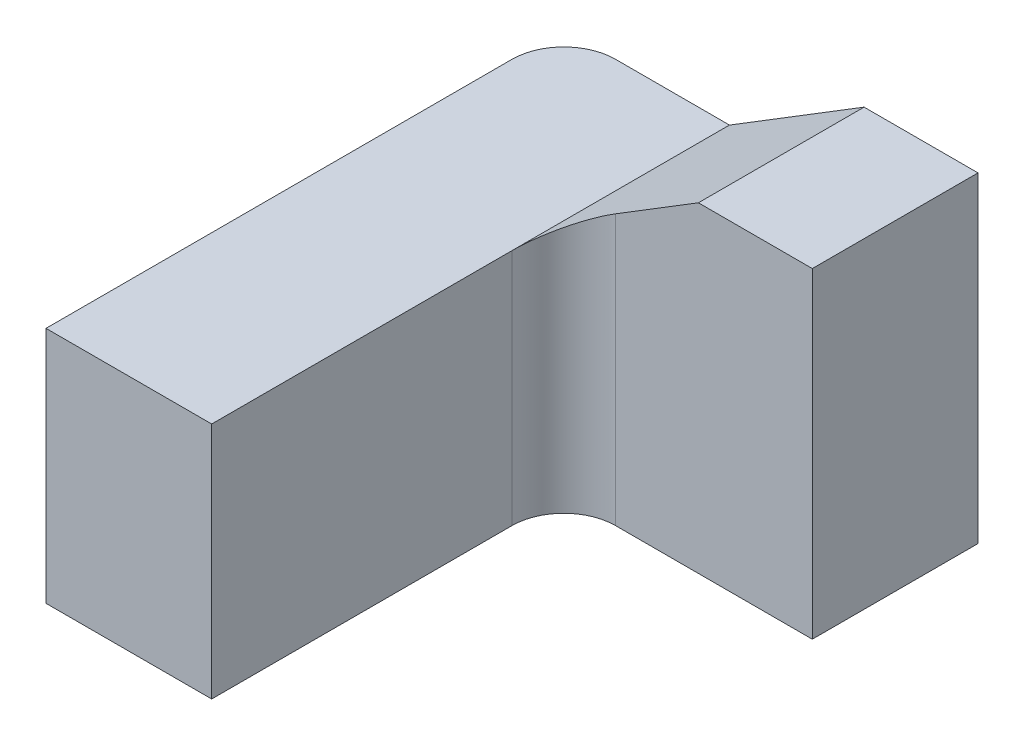
ISO-10303-21;
HEADER;
FILE_DESCRIPTION(('STEP AP214'),'2;1');
FILE_NAME('part.step','',(''),(''),'','','');
FILE_SCHEMA(('AUTOMOTIVE_DESIGN { 1 0 10303 214 1 1 1 1 }'));
ENDSEC;
DATA;
#1=APPLICATION_CONTEXT('core data for automotive mechanical design processes');
#2=APPLICATION_PROTOCOL_DEFINITION('international standard','automotive_design',2000,#1);
#3=PRODUCT_CONTEXT('',#1,'mechanical');
#4=PRODUCT('Part','Part','',(#3));
#5=PRODUCT_RELATED_PRODUCT_CATEGORY('part','',(#4));
#6=PRODUCT_DEFINITION_FORMATION('','',#4);
#7=PRODUCT_DEFINITION_CONTEXT('part definition',#1,'design');
#8=PRODUCT_DEFINITION('design','',#6,#7);
#9=PRODUCT_DEFINITION_SHAPE('','',#8);
#10=(LENGTH_UNIT() NAMED_UNIT(*) SI_UNIT(.MILLI.,.METRE.));
#11=(NAMED_UNIT(*) PLANE_ANGLE_UNIT() SI_UNIT($,.RADIAN.));
#12=(NAMED_UNIT(*) SI_UNIT($,.STERADIAN.) SOLID_ANGLE_UNIT());
#13=UNCERTAINTY_MEASURE_WITH_UNIT(LENGTH_MEASURE(1.E-05),#10,'distance_accuracy_value','');
#14=(GEOMETRIC_REPRESENTATION_CONTEXT(3) GLOBAL_UNCERTAINTY_ASSIGNED_CONTEXT((#13)) GLOBAL_UNIT_ASSIGNED_CONTEXT((#10,
#11,#12)) REPRESENTATION_CONTEXT('',''));
#15=CARTESIAN_POINT('',(0.,0.,0.));
#16=DIRECTION('',(0.,0.,1.));
#17=DIRECTION('',(1.,0.,0.));
#18=AXIS2_PLACEMENT_3D('',#15,#16,#17);
#19=CARTESIAN_POINT('',(0.,0.,0.16));
#20=DIRECTION('',(0.,0.,-1.));
#21=DIRECTION('',(-1.,0.,0.));
#22=AXIS2_PLACEMENT_3D('',#19,#20,#21);
#23=PLANE('',#22);
#24=DIRECTION('',(0.851658316704544,0.524097425664335,0.));
#25=VECTOR('',#24,1.);
#26=CARTESIAN_POINT('',(0.16,0.23,0.16));
#27=LINE('',#26,#25);
#28=CARTESIAN_POINT('',(0.21,0.260769230769231,0.16));
#29=VERTEX_POINT('',#28);
#30=CARTESIAN_POINT('',(0.29,0.31,0.16));
#31=VERTEX_POINT('',#30);
#32=EDGE_CURVE('E146',#29,#31,#27,.T.);
#33=ORIENTED_EDGE('',*,*,#32,.F.);
#34=DIRECTION('',(0.,1.,0.));
#35=VECTOR('',#34,1.);
#36=CARTESIAN_POINT('',(0.21,0.,0.16));
#37=LINE('',#36,#35);
#38=CARTESIAN_POINT('',(0.21,0.,0.16));
#39=VERTEX_POINT('',#38);
#40=EDGE_CURVE('E187',#29,#39,#37,.F.);
#41=ORIENTED_EDGE('',*,*,#40,.T.);
#42=DIRECTION('',(1.,0.,0.));
#43=VECTOR('',#42,1.);
#44=CARTESIAN_POINT('',(0.,0.,0.16));
#45=LINE('',#44,#43);
#46=CARTESIAN_POINT('',(0.4,0.,0.16));
#47=VERTEX_POINT('',#46);
#48=EDGE_CURVE('E121',#39,#47,#45,.T.);
#49=ORIENTED_EDGE('',*,*,#48,.T.);
#50=DIRECTION('',(0.,1.,0.));
#51=VECTOR('',#50,1.);
#52=CARTESIAN_POINT('',(0.4,0.,0.16));
#53=LINE('',#52,#51);
#54=CARTESIAN_POINT('',(0.4,0.31,0.16));
#55=VERTEX_POINT('',#54);
#56=EDGE_CURVE('E152',#47,#55,#53,.T.);
#57=ORIENTED_EDGE('',*,*,#56,.T.);
#58=DIRECTION('',(-1.,0.,0.));
#59=VECTOR('',#58,1.);
#60=CARTESIAN_POINT('',(0.4,0.31,0.16));
#61=LINE('',#60,#59);
#62=EDGE_CURVE('E148',#55,#31,#61,.T.);
#63=ORIENTED_EDGE('',*,*,#62,.T.);
#64=EDGE_LOOP('',(#33,#41,#49,#57,#63));
#65=FACE_BOUND('',#64,.T.);
#66=ADVANCED_FACE('F42',(#65),#23,.F.);
#67=CARTESIAN_POINT('',(0.,0.,0.16));
#68=DIRECTION('',(-1.,0.,0.));
#69=DIRECTION('',(0.,0.,1.));
#70=AXIS2_PLACEMENT_3D('',#67,#68,#69);
#71=PLANE('',#70);
#72=DIRECTION('',(0.,0.,-1.));
#73=VECTOR('',#72,1.);
#74=CARTESIAN_POINT('',(0.,0.23,0.16));
#75=LINE('',#74,#73);
#76=CARTESIAN_POINT('',(0.,0.23,0.5));
#77=VERTEX_POINT('',#76);
#78=CARTESIAN_POINT('',(0.,0.23,0.05));
#79=VERTEX_POINT('',#78);
#80=EDGE_CURVE('E110',#77,#79,#75,.T.);
#81=ORIENTED_EDGE('',*,*,#80,.T.);
#82=DIRECTION('',(0.,1.,0.));
#83=VECTOR('',#82,1.);
#84=CARTESIAN_POINT('',(0.,0.,0.05));
#85=LINE('',#84,#83);
#86=CARTESIAN_POINT('',(0.,0.,0.05));
#87=VERTEX_POINT('',#86);
#88=EDGE_CURVE('E180',#79,#87,#85,.F.);
#89=ORIENTED_EDGE('',*,*,#88,.T.);
#90=DIRECTION('',(0.,0.,-1.));
#91=VECTOR('',#90,1.);
#92=CARTESIAN_POINT('',(0.,0.,0.16));
#93=LINE('',#92,#91);
#94=CARTESIAN_POINT('',(0.,0.,0.5));
#95=VERTEX_POINT('',#94);
#96=EDGE_CURVE('E127',#95,#87,#93,.T.);
#97=ORIENTED_EDGE('',*,*,#96,.F.);
#98=DIRECTION('',(0.,-1.,0.));
#99=VECTOR('',#98,1.);
#100=CARTESIAN_POINT('',(0.,0.,0.5));
#101=LINE('',#100,#99);
#102=EDGE_CURVE('E124',#77,#95,#101,.T.);
#103=ORIENTED_EDGE('',*,*,#102,.F.);
#104=EDGE_LOOP('',(#81,#89,#97,#103));
#105=FACE_BOUND('',#104,.T.);
#106=ADVANCED_FACE('F125',(#105),#71,.T.);
#107=CARTESIAN_POINT('',(0.,0.,0.16));
#108=DIRECTION('',(0.,1.,0.));
#109=DIRECTION('',(0.,0.,1.));
#110=AXIS2_PLACEMENT_3D('',#107,#108,#109);
#111=PLANE('',#110);
#112=ORIENTED_EDGE('',*,*,#96,.T.);
#113=CARTESIAN_POINT('',(0.05,0.,0.05));
#114=DIRECTION('',(0.,1.,0.));
#115=DIRECTION('',(0.,0.,1.));
#116=AXIS2_PLACEMENT_3D('',#113,#114,#115);
#117=CIRCLE('',#116,0.05);
#118=CARTESIAN_POINT('',(0.05,0.,0.));
#119=VERTEX_POINT('',#118);
#120=EDGE_CURVE('E182',#87,#119,#117,.F.);
#121=ORIENTED_EDGE('',*,*,#120,.T.);
#122=DIRECTION('',(1.,0.,0.));
#123=VECTOR('',#122,1.);
#124=CARTESIAN_POINT('',(0.,0.,0.));
#125=LINE('',#124,#123);
#126=CARTESIAN_POINT('',(0.4,0.,0.));
#127=VERTEX_POINT('',#126);
#128=EDGE_CURVE('E149',#119,#127,#125,.T.);
#129=ORIENTED_EDGE('',*,*,#128,.T.);
#130=DIRECTION('',(0.,0.,-1.));
#131=VECTOR('',#130,1.);
#132=CARTESIAN_POINT('',(0.4,0.,0.16));
#133=LINE('',#132,#131);
#134=EDGE_CURVE('E167',#47,#127,#133,.T.);
#135=ORIENTED_EDGE('',*,*,#134,.F.);
#136=ORIENTED_EDGE('',*,*,#48,.F.);
#137=CARTESIAN_POINT('',(0.21,0.,0.21));
#138=DIRECTION('',(0.,1.,0.));
#139=DIRECTION('',(0.,0.,1.));
#140=AXIS2_PLACEMENT_3D('',#137,#138,#139);
#141=CIRCLE('',#140,0.05);
#142=CARTESIAN_POINT('',(0.16,0.,0.21));
#143=VERTEX_POINT('',#142);
#144=EDGE_CURVE('E11',#39,#143,#141,.T.);
#145=ORIENTED_EDGE('',*,*,#144,.T.);
#146=DIRECTION('',(0.,0.,-1.));
#147=VECTOR('',#146,1.);
#148=CARTESIAN_POINT('',(0.16,0.,0.5));
#149=LINE('',#148,#147);
#150=CARTESIAN_POINT('',(0.16,0.,0.5));
#151=VERTEX_POINT('',#150);
#152=EDGE_CURVE('E142',#151,#143,#149,.T.);
#153=ORIENTED_EDGE('',*,*,#152,.F.);
#154=DIRECTION('',(1.,0.,0.));
#155=VECTOR('',#154,1.);
#156=CARTESIAN_POINT('',(0.16,0.,0.5));
#157=LINE('',#156,#155);
#158=EDGE_CURVE('E130',#95,#151,#157,.T.);
#159=ORIENTED_EDGE('',*,*,#158,.F.);
#160=EDGE_LOOP('',(#112,#121,#129,#135,#136,#145,#153,#159));
#161=FACE_BOUND('',#160,.T.);
#162=ADVANCED_FACE('F195',(#161),#111,.F.);
#163=CARTESIAN_POINT('',(0.4,0.,0.16));
#164=DIRECTION('',(-1.,0.,0.));
#165=DIRECTION('',(0.,0.,1.));
#166=AXIS2_PLACEMENT_3D('',#163,#164,#165);
#167=PLANE('',#166);
#168=DIRECTION('',(0.,1.,0.));
#169=VECTOR('',#168,1.);
#170=CARTESIAN_POINT('',(0.4,0.,0.));
#171=LINE('',#170,#169);
#172=CARTESIAN_POINT('',(0.4,0.31,0.));
#173=VERTEX_POINT('',#172);
#174=EDGE_CURVE('E162',#127,#173,#171,.T.);
#175=ORIENTED_EDGE('',*,*,#174,.T.);
#176=DIRECTION('',(0.,0.,-1.));
#177=VECTOR('',#176,1.);
#178=CARTESIAN_POINT('',(0.4,0.31,0.16));
#179=LINE('',#178,#177);
#180=EDGE_CURVE('E170',#55,#173,#179,.T.);
#181=ORIENTED_EDGE('',*,*,#180,.F.);
#182=ORIENTED_EDGE('',*,*,#56,.F.);
#183=ORIENTED_EDGE('',*,*,#134,.T.);
#184=EDGE_LOOP('',(#175,#181,#182,#183));
#185=FACE_BOUND('',#184,.T.);
#186=ADVANCED_FACE('F214',(#185),#167,.F.);
#187=CARTESIAN_POINT('',(0.4,0.31,0.16));
#188=DIRECTION('',(0.,-1.,0.));
#189=DIRECTION('',(0.,0.,-1.));
#190=AXIS2_PLACEMENT_3D('',#187,#188,#189);
#191=PLANE('',#190);
#192=DIRECTION('',(-1.,0.,0.));
#193=VECTOR('',#192,1.);
#194=CARTESIAN_POINT('',(0.4,0.31,0.));
#195=LINE('',#194,#193);
#196=CARTESIAN_POINT('',(0.29,0.31,0.));
#197=VERTEX_POINT('',#196);
#198=EDGE_CURVE('E159',#173,#197,#195,.T.);
#199=ORIENTED_EDGE('',*,*,#198,.T.);
#200=DIRECTION('',(0.,0.,-1.));
#201=VECTOR('',#200,1.);
#202=CARTESIAN_POINT('',(0.29,0.31,0.16));
#203=LINE('',#202,#201);
#204=EDGE_CURVE('E173',#31,#197,#203,.T.);
#205=ORIENTED_EDGE('',*,*,#204,.F.);
#206=ORIENTED_EDGE('',*,*,#62,.F.);
#207=ORIENTED_EDGE('',*,*,#180,.T.);
#208=EDGE_LOOP('',(#199,#205,#206,#207));
#209=FACE_BOUND('',#208,.T.);
#210=ADVANCED_FACE('F218',(#209),#191,.F.);
#211=CARTESIAN_POINT('',(0.16,0.23,0.16));
#212=DIRECTION('',(-0.524097425664335,0.851658316704544,0.));
#213=DIRECTION('',(-0.851658316704544,-0.524097425664335,0.));
#214=AXIS2_PLACEMENT_3D('',#211,#212,#213);
#215=PLANE('',#214);
#216=DIRECTION('',(0.851658316704544,0.524097425664335,0.));
#217=VECTOR('',#216,1.);
#218=CARTESIAN_POINT('',(0.16,0.23,0.));
#219=LINE('',#218,#217);
#220=CARTESIAN_POINT('',(0.16,0.23,0.));
#221=VERTEX_POINT('',#220);
#222=EDGE_CURVE('E156',#221,#197,#219,.T.);
#223=ORIENTED_EDGE('',*,*,#222,.F.);
#224=DIRECTION('',(0.,0.,-1.));
#225=VECTOR('',#224,1.);
#226=CARTESIAN_POINT('',(0.16,0.23,0.16));
#227=LINE('',#226,#225);
#228=CARTESIAN_POINT('',(0.16,0.23,0.21));
#229=VERTEX_POINT('',#228);
#230=EDGE_CURVE('E120',#229,#221,#227,.T.);
#231=ORIENTED_EDGE('',*,*,#230,.F.);
#232=CARTESIAN_POINT('',(0.21,0.260769230769231,0.21));
#233=DIRECTION('',(-0.524097425664335,0.851658316704544,0.));
#234=DIRECTION('',(-0.851658316704544,-0.524097425664335,0.));
#235=AXIS2_PLACEMENT_3D('',#232,#233,#234);
#236=ELLIPSE('',#235,0.0587089904710529,0.05);
#237=EDGE_CURVE('E51',#229,#29,#236,.F.);
#238=ORIENTED_EDGE('',*,*,#237,.T.);
#239=ORIENTED_EDGE('',*,*,#32,.T.);
#240=ORIENTED_EDGE('',*,*,#204,.T.);
#241=EDGE_LOOP('',(#223,#231,#238,#239,#240));
#242=FACE_BOUND('',#241,.T.);
#243=ADVANCED_FACE('F202',(#242),#215,.T.);
#244=CARTESIAN_POINT('',(0.,0.23,0.16));
#245=DIRECTION('',(0.,1.,0.));
#246=DIRECTION('',(0.,0.,1.));
#247=AXIS2_PLACEMENT_3D('',#244,#245,#246);
#248=PLANE('',#247);
#249=DIRECTION('',(1.,0.,0.));
#250=VECTOR('',#249,1.);
#251=CARTESIAN_POINT('',(0.,0.23,0.));
#252=LINE('',#251,#250);
#253=CARTESIAN_POINT('',(0.05,0.23,0.));
#254=VERTEX_POINT('',#253);
#255=EDGE_CURVE('E145',#254,#221,#252,.T.);
#256=ORIENTED_EDGE('',*,*,#255,.F.);
#257=CARTESIAN_POINT('',(0.05,0.23,0.05));
#258=DIRECTION('',(0.,1.,0.));
#259=DIRECTION('',(0.,0.,1.));
#260=AXIS2_PLACEMENT_3D('',#257,#258,#259);
#261=CIRCLE('',#260,0.05);
#262=EDGE_CURVE('E117',#254,#79,#261,.T.);
#263=ORIENTED_EDGE('',*,*,#262,.T.);
#264=ORIENTED_EDGE('',*,*,#80,.F.);
#265=DIRECTION('',(-1.,0.,0.));
#266=VECTOR('',#265,1.);
#267=CARTESIAN_POINT('',(0.16,0.23,0.5));
#268=LINE('',#267,#266);
#269=CARTESIAN_POINT('',(0.16,0.23,0.5));
#270=VERTEX_POINT('',#269);
#271=EDGE_CURVE('E116',#270,#77,#268,.T.);
#272=ORIENTED_EDGE('',*,*,#271,.F.);
#273=DIRECTION('',(0.,0.,-1.));
#274=VECTOR('',#273,1.);
#275=CARTESIAN_POINT('',(0.16,0.23,0.5));
#276=LINE('',#275,#274);
#277=EDGE_CURVE('E140',#270,#229,#276,.T.);
#278=ORIENTED_EDGE('',*,*,#277,.T.);
#279=ORIENTED_EDGE('',*,*,#230,.T.);
#280=EDGE_LOOP('',(#256,#263,#264,#272,#278,#279));
#281=FACE_BOUND('',#280,.T.);
#282=ADVANCED_FACE('F113',(#281),#248,.T.);
#283=CARTESIAN_POINT('',(0.,0.,0.));
#284=DIRECTION('',(0.,0.,-1.));
#285=DIRECTION('',(-1.,0.,0.));
#286=AXIS2_PLACEMENT_3D('',#283,#284,#285);
#287=PLANE('',#286);
#288=ORIENTED_EDGE('',*,*,#128,.F.);
#289=DIRECTION('',(0.,1.,0.));
#290=VECTOR('',#289,1.);
#291=CARTESIAN_POINT('',(0.05,0.,0.));
#292=LINE('',#291,#290);
#293=EDGE_CURVE('E166',#119,#254,#292,.T.);
#294=ORIENTED_EDGE('',*,*,#293,.T.);
#295=ORIENTED_EDGE('',*,*,#255,.T.);
#296=ORIENTED_EDGE('',*,*,#222,.T.);
#297=ORIENTED_EDGE('',*,*,#198,.F.);
#298=ORIENTED_EDGE('',*,*,#174,.F.);
#299=EDGE_LOOP('',(#288,#294,#295,#296,#297,#298));
#300=FACE_BOUND('',#299,.T.);
#301=ADVANCED_FACE('F207',(#300),#287,.T.);
#302=CARTESIAN_POINT('',(0.16,0.,0.5));
#303=DIRECTION('',(-1.,0.,0.));
#304=DIRECTION('',(0.,-1.,0.));
#305=AXIS2_PLACEMENT_3D('',#302,#303,#304);
#306=PLANE('',#305);
#307=ORIENTED_EDGE('',*,*,#152,.T.);
#308=DIRECTION('',(0.,1.,0.));
#309=VECTOR('',#308,1.);
#310=CARTESIAN_POINT('',(0.16,0.23,0.21));
#311=LINE('',#310,#309);
#312=EDGE_CURVE('E184',#143,#229,#311,.T.);
#313=ORIENTED_EDGE('',*,*,#312,.T.);
#314=ORIENTED_EDGE('',*,*,#277,.F.);
#315=DIRECTION('',(0.,1.,0.));
#316=VECTOR('',#315,1.);
#317=CARTESIAN_POINT('',(0.16,0.,0.5));
#318=LINE('',#317,#316);
#319=EDGE_CURVE('E134',#151,#270,#318,.T.);
#320=ORIENTED_EDGE('',*,*,#319,.F.);
#321=EDGE_LOOP('',(#307,#313,#314,#320));
#322=FACE_BOUND('',#321,.T.);
#323=ADVANCED_FACE('F200',(#322),#306,.F.);
#324=CARTESIAN_POINT('',(0.,0.,0.5));
#325=DIRECTION('',(0.,0.,-1.));
#326=DIRECTION('',(-1.,0.,0.));
#327=AXIS2_PLACEMENT_3D('',#324,#325,#326);
#328=PLANE('',#327);
#329=ORIENTED_EDGE('',*,*,#271,.T.);
#330=ORIENTED_EDGE('',*,*,#102,.T.);
#331=ORIENTED_EDGE('',*,*,#158,.T.);
#332=ORIENTED_EDGE('',*,*,#319,.T.);
#333=EDGE_LOOP('',(#329,#330,#331,#332));
#334=FACE_BOUND('',#333,.T.);
#335=ADVANCED_FACE('F132',(#334),#328,.F.);
#336=CARTESIAN_POINT('',(0.05,0.,0.05));
#337=DIRECTION('',(0.,1.,0.));
#338=DIRECTION('',(0.,0.,1.));
#339=AXIS2_PLACEMENT_3D('',#336,#337,#338);
#340=CYLINDRICAL_SURFACE('',#339,0.05);
#341=ORIENTED_EDGE('',*,*,#120,.F.);
#342=ORIENTED_EDGE('',*,*,#88,.F.);
#343=ORIENTED_EDGE('',*,*,#262,.F.);
#344=ORIENTED_EDGE('',*,*,#293,.F.);
#345=EDGE_LOOP('',(#341,#342,#343,#344));
#346=FACE_BOUND('',#345,.T.);
#347=ADVANCED_FACE('F212',(#346),#340,.T.);
#348=CARTESIAN_POINT('',(0.21,0.,0.21));
#349=DIRECTION('',(0.,-1.,0.));
#350=DIRECTION('',(1.,0.,0.));
#351=AXIS2_PLACEMENT_3D('',#348,#349,#350);
#352=CYLINDRICAL_SURFACE('',#351,0.05);
#353=ORIENTED_EDGE('',*,*,#144,.F.);
#354=ORIENTED_EDGE('',*,*,#40,.F.);
#355=ORIENTED_EDGE('',*,*,#237,.F.);
#356=ORIENTED_EDGE('',*,*,#312,.F.);
#357=EDGE_LOOP('',(#353,#354,#355,#356));
#358=FACE_BOUND('',#357,.T.);
#359=ADVANCED_FACE('F44',(#358),#352,.F.);
#360=CLOSED_SHELL('',(#66,#106,#162,#186,#210,#243,#282,#301,#323,#335,#347,#359));
#361=MANIFOLD_SOLID_BREP('B2',#360);
#362=ADVANCED_BREP_SHAPE_REPRESENTATION('',(#18,#361),#14);
#363=SHAPE_DEFINITION_REPRESENTATION(#9,#362);
ENDSEC;
END-ISO-10303-21;
